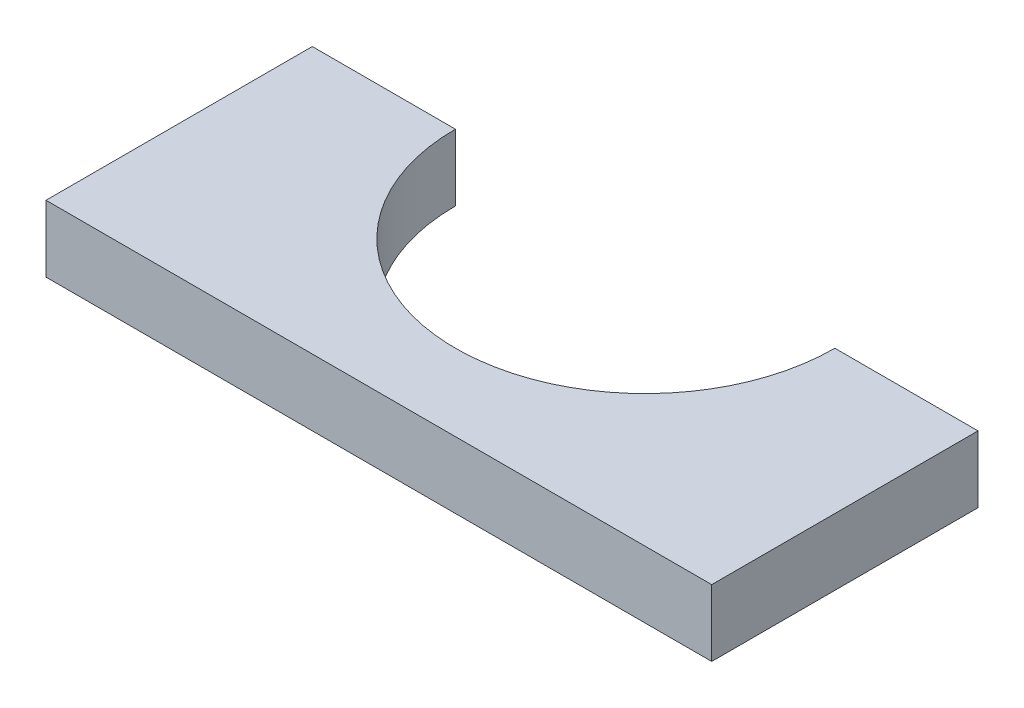
ISO-10303-21;
HEADER;
FILE_DESCRIPTION(('STEP AP214'),'2;1');
FILE_NAME('part.step','',(''),(''),'','','');
FILE_SCHEMA(('AUTOMOTIVE_DESIGN { 1 0 10303 214 1 1 1 1 }'));
ENDSEC;
DATA;
#1=APPLICATION_CONTEXT('core data for automotive mechanical design processes');
#2=APPLICATION_PROTOCOL_DEFINITION('international standard','automotive_design',2000,#1);
#3=PRODUCT_CONTEXT('',#1,'mechanical');
#4=PRODUCT('Part','Part','',(#3));
#5=PRODUCT_RELATED_PRODUCT_CATEGORY('part','',(#4));
#6=PRODUCT_DEFINITION_FORMATION('','',#4);
#7=PRODUCT_DEFINITION_CONTEXT('part definition',#1,'design');
#8=PRODUCT_DEFINITION('design','',#6,#7);
#9=PRODUCT_DEFINITION_SHAPE('','',#8);
#10=(LENGTH_UNIT() NAMED_UNIT(*) SI_UNIT(.MILLI.,.METRE.));
#11=(NAMED_UNIT(*) PLANE_ANGLE_UNIT() SI_UNIT($,.RADIAN.));
#12=(NAMED_UNIT(*) SI_UNIT($,.STERADIAN.) SOLID_ANGLE_UNIT());
#13=UNCERTAINTY_MEASURE_WITH_UNIT(LENGTH_MEASURE(1.E-05),#10,'distance_accuracy_value','');
#14=(GEOMETRIC_REPRESENTATION_CONTEXT(3) GLOBAL_UNCERTAINTY_ASSIGNED_CONTEXT((#13)) GLOBAL_UNIT_ASSIGNED_CONTEXT((#10,
#11,#12)) REPRESENTATION_CONTEXT('',''));
#15=CARTESIAN_POINT('',(0.,0.,0.));
#16=DIRECTION('',(0.,0.,1.));
#17=DIRECTION('',(1.,0.,0.));
#18=AXIS2_PLACEMENT_3D('',#15,#16,#17);
#19=CARTESIAN_POINT('',(-100.,20.,-80.));
#20=DIRECTION('',(1.,0.,0.));
#21=DIRECTION('',(0.,0.,-1.));
#22=AXIS2_PLACEMENT_3D('',#19,#20,#21);
#23=PLANE('',#22);
#24=DIRECTION('',(0.,0.,1.));
#25=VECTOR('',#24,1.);
#26=CARTESIAN_POINT('',(-100.,0.,-80.));
#27=LINE('',#26,#25);
#28=CARTESIAN_POINT('',(-100.,0.,-80.));
#29=VERTEX_POINT('',#28);
#30=CARTESIAN_POINT('',(-100.,0.,0.));
#31=VERTEX_POINT('',#30);
#32=EDGE_CURVE('E128',#29,#31,#27,.T.);
#33=ORIENTED_EDGE('',*,*,#32,.T.);
#34=DIRECTION('',(0.,-1.,0.));
#35=VECTOR('',#34,1.);
#36=CARTESIAN_POINT('',(-100.,20.,0.));
#37=LINE('',#36,#35);
#38=CARTESIAN_POINT('',(-100.,20.,0.));
#39=VERTEX_POINT('',#38);
#40=EDGE_CURVE('E11',#39,#31,#37,.T.);
#41=ORIENTED_EDGE('',*,*,#40,.F.);
#42=DIRECTION('',(0.,0.,1.));
#43=VECTOR('',#42,1.);
#44=CARTESIAN_POINT('',(-100.,20.,-80.));
#45=LINE('',#44,#43);
#46=CARTESIAN_POINT('',(-100.,20.,-80.));
#47=VERTEX_POINT('',#46);
#48=EDGE_CURVE('E144',#47,#39,#45,.T.);
#49=ORIENTED_EDGE('',*,*,#48,.F.);
#50=DIRECTION('',(0.,-1.,0.));
#51=VECTOR('',#50,1.);
#52=CARTESIAN_POINT('',(-100.,20.,-80.));
#53=LINE('',#52,#51);
#54=EDGE_CURVE('E124',#47,#29,#53,.T.);
#55=ORIENTED_EDGE('',*,*,#54,.T.);
#56=EDGE_LOOP('',(#33,#41,#49,#55));
#57=FACE_BOUND('',#56,.T.);
#58=ADVANCED_FACE('F39',(#57),#23,.F.);
#59=CARTESIAN_POINT('',(-100.,20.,0.));
#60=DIRECTION('',(0.,0.,-1.));
#61=DIRECTION('',(-1.,0.,0.));
#62=AXIS2_PLACEMENT_3D('',#59,#60,#61);
#63=PLANE('',#62);
#64=DIRECTION('',(1.,0.,0.));
#65=VECTOR('',#64,1.);
#66=CARTESIAN_POINT('',(-100.,0.,0.));
#67=LINE('',#66,#65);
#68=CARTESIAN_POINT('',(100.,0.,0.));
#69=VERTEX_POINT('',#68);
#70=EDGE_CURVE('E132',#31,#69,#67,.T.);
#71=ORIENTED_EDGE('',*,*,#70,.T.);
#72=DIRECTION('',(0.,-1.,0.));
#73=VECTOR('',#72,1.);
#74=CARTESIAN_POINT('',(100.,20.,0.));
#75=LINE('',#74,#73);
#76=CARTESIAN_POINT('',(100.,20.,0.));
#77=VERTEX_POINT('',#76);
#78=EDGE_CURVE('E48',#77,#69,#75,.T.);
#79=ORIENTED_EDGE('',*,*,#78,.F.);
#80=DIRECTION('',(1.,0.,0.));
#81=VECTOR('',#80,1.);
#82=CARTESIAN_POINT('',(-100.,20.,0.));
#83=LINE('',#82,#81);
#84=EDGE_CURVE('E93',#39,#77,#83,.T.);
#85=ORIENTED_EDGE('',*,*,#84,.F.);
#86=ORIENTED_EDGE('',*,*,#40,.T.);
#87=EDGE_LOOP('',(#71,#79,#85,#86));
#88=FACE_BOUND('',#87,.T.);
#89=ADVANCED_FACE('F172',(#88),#63,.F.);
#90=CARTESIAN_POINT('',(100.,20.,-80.0000000000001));
#91=DIRECTION('',(-1.,0.,0.));
#92=DIRECTION('',(0.,0.,1.));
#93=AXIS2_PLACEMENT_3D('',#90,#91,#92);
#94=PLANE('',#93);
#95=DIRECTION('',(0.,0.,-1.));
#96=VECTOR('',#95,1.);
#97=CARTESIAN_POINT('',(100.,0.,-80.0000000000001));
#98=LINE('',#97,#96);
#99=CARTESIAN_POINT('',(100.,0.,-80.0000000000001));
#100=VERTEX_POINT('',#99);
#101=EDGE_CURVE('E135',#69,#100,#98,.T.);
#102=ORIENTED_EDGE('',*,*,#101,.T.);
#103=DIRECTION('',(0.,-1.,0.));
#104=VECTOR('',#103,1.);
#105=CARTESIAN_POINT('',(100.,20.,-80.0000000000001));
#106=LINE('',#105,#104);
#107=CARTESIAN_POINT('',(100.,20.,-80.0000000000001));
#108=VERTEX_POINT('',#107);
#109=EDGE_CURVE('E117',#108,#100,#106,.T.);
#110=ORIENTED_EDGE('',*,*,#109,.F.);
#111=DIRECTION('',(0.,0.,-1.));
#112=VECTOR('',#111,1.);
#113=CARTESIAN_POINT('',(100.,20.,-80.0000000000001));
#114=LINE('',#113,#112);
#115=EDGE_CURVE('E106',#77,#108,#114,.T.);
#116=ORIENTED_EDGE('',*,*,#115,.F.);
#117=ORIENTED_EDGE('',*,*,#78,.T.);
#118=EDGE_LOOP('',(#102,#110,#116,#117));
#119=FACE_BOUND('',#118,.T.);
#120=ADVANCED_FACE('F154',(#119),#94,.F.);
#121=CARTESIAN_POINT('',(57.,20.,-80.0000000000001));
#122=DIRECTION('',(0.,0.,1.));
#123=DIRECTION('',(1.,0.,0.));
#124=AXIS2_PLACEMENT_3D('',#121,#122,#123);
#125=PLANE('',#124);
#126=DIRECTION('',(-1.,0.,0.));
#127=VECTOR('',#126,1.);
#128=CARTESIAN_POINT('',(57.,0.,-80.0000000000001));
#129=LINE('',#128,#127);
#130=CARTESIAN_POINT('',(57.,0.,-80.0000000000001));
#131=VERTEX_POINT('',#130);
#132=EDGE_CURVE('E115',#100,#131,#129,.T.);
#133=ORIENTED_EDGE('',*,*,#132,.T.);
#134=DIRECTION('',(0.,-1.,0.));
#135=VECTOR('',#134,1.);
#136=CARTESIAN_POINT('',(57.,20.,-80.0000000000001));
#137=LINE('',#136,#135);
#138=CARTESIAN_POINT('',(57.,20.,-80.0000000000001));
#139=VERTEX_POINT('',#138);
#140=EDGE_CURVE('E112',#139,#131,#137,.T.);
#141=ORIENTED_EDGE('',*,*,#140,.F.);
#142=DIRECTION('',(-1.,0.,0.));
#143=VECTOR('',#142,1.);
#144=CARTESIAN_POINT('',(57.,20.,-80.0000000000001));
#145=LINE('',#144,#143);
#146=EDGE_CURVE('E100',#108,#139,#145,.T.);
#147=ORIENTED_EDGE('',*,*,#146,.F.);
#148=ORIENTED_EDGE('',*,*,#109,.T.);
#149=EDGE_LOOP('',(#133,#141,#147,#148));
#150=FACE_BOUND('',#149,.T.);
#151=ADVANCED_FACE('F113',(#150),#125,.F.);
#152=CARTESIAN_POINT('',(0.,20.,-80.0000000000001));
#153=DIRECTION('',(0.,-1.,0.));
#154=DIRECTION('',(0.,0.,-1.));
#155=AXIS2_PLACEMENT_3D('',#152,#153,#154);
#156=CYLINDRICAL_SURFACE('',#155,57.);
#157=CARTESIAN_POINT('',(0.,0.,-80.0000000000001));
#158=DIRECTION('',(0.,-1.,0.));
#159=DIRECTION('',(0.,0.,1.));
#160=AXIS2_PLACEMENT_3D('',#157,#158,#159);
#161=CIRCLE('',#160,57.);
#162=CARTESIAN_POINT('',(-57.,0.,-80.0000000000001));
#163=VERTEX_POINT('',#162);
#164=EDGE_CURVE('E79',#131,#163,#161,.T.);
#165=ORIENTED_EDGE('',*,*,#164,.T.);
#166=DIRECTION('',(0.,-1.,0.));
#167=VECTOR('',#166,1.);
#168=CARTESIAN_POINT('',(-57.,20.,-80.0000000000001));
#169=LINE('',#168,#167);
#170=CARTESIAN_POINT('',(-57.,20.,-80.0000000000001));
#171=VERTEX_POINT('',#170);
#172=EDGE_CURVE('E118',#171,#163,#169,.T.);
#173=ORIENTED_EDGE('',*,*,#172,.F.);
#174=CARTESIAN_POINT('',(0.,20.,-80.0000000000001));
#175=DIRECTION('',(0.,-1.,0.));
#176=DIRECTION('',(0.,0.,1.));
#177=AXIS2_PLACEMENT_3D('',#174,#175,#176);
#178=CIRCLE('',#177,57.);
#179=EDGE_CURVE('E104',#139,#171,#178,.T.);
#180=ORIENTED_EDGE('',*,*,#179,.F.);
#181=ORIENTED_EDGE('',*,*,#140,.T.);
#182=EDGE_LOOP('',(#165,#173,#180,#181));
#183=FACE_BOUND('',#182,.T.);
#184=ADVANCED_FACE('F120',(#183),#156,.F.);
#185=CARTESIAN_POINT('',(-57.,20.,-80.));
#186=DIRECTION('',(0.,0.,1.));
#187=DIRECTION('',(1.,0.,0.));
#188=AXIS2_PLACEMENT_3D('',#185,#186,#187);
#189=PLANE('',#188);
#190=DIRECTION('',(-1.,0.,0.));
#191=VECTOR('',#190,1.);
#192=CARTESIAN_POINT('',(-57.,0.,-80.));
#193=LINE('',#192,#191);
#194=EDGE_CURVE('E85',#163,#29,#193,.T.);
#195=ORIENTED_EDGE('',*,*,#194,.T.);
#196=ORIENTED_EDGE('',*,*,#54,.F.);
#197=DIRECTION('',(-1.,0.,0.));
#198=VECTOR('',#197,1.);
#199=CARTESIAN_POINT('',(-57.,20.,-80.));
#200=LINE('',#199,#198);
#201=EDGE_CURVE('E56',#171,#47,#200,.T.);
#202=ORIENTED_EDGE('',*,*,#201,.F.);
#203=ORIENTED_EDGE('',*,*,#172,.T.);
#204=EDGE_LOOP('',(#195,#196,#202,#203));
#205=FACE_BOUND('',#204,.T.);
#206=ADVANCED_FACE('F161',(#205),#189,.F.);
#207=CARTESIAN_POINT('',(0.,20.,-80.0000000000001));
#208=DIRECTION('',(0.,1.,0.));
#209=DIRECTION('',(0.,0.,1.));
#210=AXIS2_PLACEMENT_3D('',#207,#208,#209);
#211=PLANE('',#210);
#212=ORIENTED_EDGE('',*,*,#48,.T.);
#213=ORIENTED_EDGE('',*,*,#84,.T.);
#214=ORIENTED_EDGE('',*,*,#115,.T.);
#215=ORIENTED_EDGE('',*,*,#146,.T.);
#216=ORIENTED_EDGE('',*,*,#179,.T.);
#217=ORIENTED_EDGE('',*,*,#201,.T.);
#218=EDGE_LOOP('',(#212,#213,#214,#215,#216,#217));
#219=FACE_BOUND('',#218,.T.);
#220=ADVANCED_FACE('F102',(#219),#211,.T.);
#221=CARTESIAN_POINT('',(0.,0.,-80.0000000000001));
#222=DIRECTION('',(0.,1.,0.));
#223=DIRECTION('',(0.,0.,1.));
#224=AXIS2_PLACEMENT_3D('',#221,#222,#223);
#225=PLANE('',#224);
#226=ORIENTED_EDGE('',*,*,#32,.F.);
#227=ORIENTED_EDGE('',*,*,#194,.F.);
#228=ORIENTED_EDGE('',*,*,#164,.F.);
#229=ORIENTED_EDGE('',*,*,#132,.F.);
#230=ORIENTED_EDGE('',*,*,#101,.F.);
#231=ORIENTED_EDGE('',*,*,#70,.F.);
#232=EDGE_LOOP('',(#226,#227,#228,#229,#230,#231));
#233=FACE_BOUND('',#232,.T.);
#234=ADVANCED_FACE('F157',(#233),#225,.F.);
#235=CLOSED_SHELL('',(#58,#89,#120,#151,#184,#206,#220,#234));
#236=MANIFOLD_SOLID_BREP('B2',#235);
#237=ADVANCED_BREP_SHAPE_REPRESENTATION('',(#18,#236),#14);
#238=SHAPE_DEFINITION_REPRESENTATION(#9,#237);
ENDSEC;
END-ISO-10303-21;
